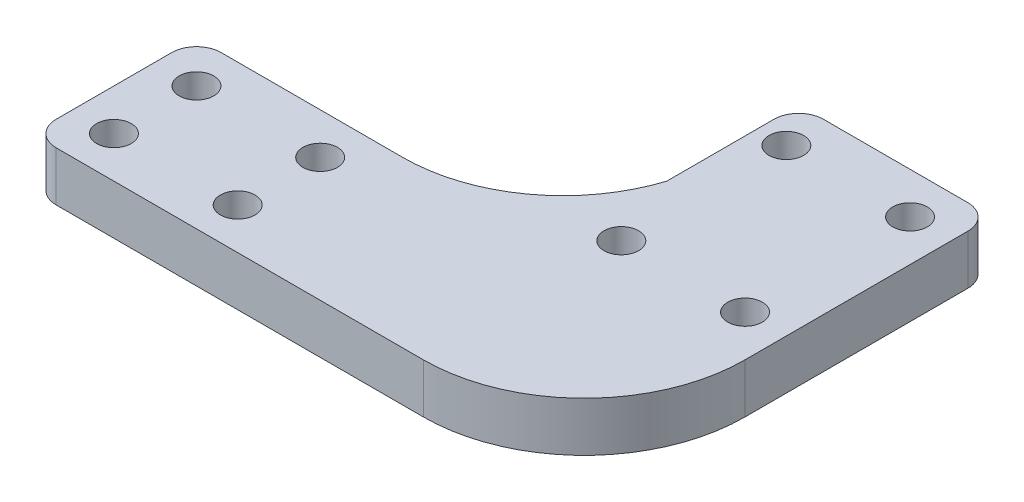
ISO-10303-21;
HEADER;
FILE_DESCRIPTION(('STEP AP214'),'2;1');
FILE_NAME('part.step','',(''),(''),'','','');
FILE_SCHEMA(('AUTOMOTIVE_DESIGN { 1 0 10303 214 1 1 1 1 }'));
ENDSEC;
DATA;
#1=APPLICATION_CONTEXT('core data for automotive mechanical design processes');
#2=APPLICATION_PROTOCOL_DEFINITION('international standard','automotive_design',2000,#1);
#3=PRODUCT_CONTEXT('',#1,'mechanical');
#4=PRODUCT('Part','Part','',(#3));
#5=PRODUCT_RELATED_PRODUCT_CATEGORY('part','',(#4));
#6=PRODUCT_DEFINITION_FORMATION('','',#4);
#7=PRODUCT_DEFINITION_CONTEXT('part definition',#1,'design');
#8=PRODUCT_DEFINITION('design','',#6,#7);
#9=PRODUCT_DEFINITION_SHAPE('','',#8);
#10=(LENGTH_UNIT() NAMED_UNIT(*) SI_UNIT(.MILLI.,.METRE.));
#11=(NAMED_UNIT(*) PLANE_ANGLE_UNIT() SI_UNIT($,.RADIAN.));
#12=(NAMED_UNIT(*) SI_UNIT($,.STERADIAN.) SOLID_ANGLE_UNIT());
#13=UNCERTAINTY_MEASURE_WITH_UNIT(LENGTH_MEASURE(1.E-05),#10,'distance_accuracy_value','');
#14=(GEOMETRIC_REPRESENTATION_CONTEXT(3) GLOBAL_UNCERTAINTY_ASSIGNED_CONTEXT((#13)) GLOBAL_UNIT_ASSIGNED_CONTEXT((#10,
#11,#12)) REPRESENTATION_CONTEXT('',''));
#15=CARTESIAN_POINT('',(0.,0.,0.));
#16=DIRECTION('',(0.,0.,1.));
#17=DIRECTION('',(1.,0.,0.));
#18=AXIS2_PLACEMENT_3D('',#15,#16,#17);
#19=CARTESIAN_POINT('',(-29.5,6.,-4.92592592592592));
#20=DIRECTION('',(0.,1.,0.));
#21=DIRECTION('',(0.,0.,1.));
#22=AXIS2_PLACEMENT_3D('',#19,#20,#21);
#23=PLANE('',#22);
#24=CARTESIAN_POINT('',(7.5,6.,-10.));
#25=DIRECTION('',(0.,1.,0.));
#26=DIRECTION('',(0.,0.,1.));
#27=AXIS2_PLACEMENT_3D('',#24,#25,#26);
#28=CIRCLE('',#27,2.1);
#29=CARTESIAN_POINT('',(7.5,6.,-7.9));
#30=VERTEX_POINT('',#29);
#31=EDGE_CURVE('E289',#30,#30,#28,.T.);
#32=ORIENTED_EDGE('',*,*,#31,.F.);
#33=EDGE_LOOP('',(#32));
#34=FACE_BOUND('',#33,.T.);
#35=CARTESIAN_POINT('',(-49.5,6.,29.5));
#36=DIRECTION('',(0.,1.,0.));
#37=DIRECTION('',(0.,0.,-1.));
#38=AXIS2_PLACEMENT_3D('',#35,#36,#37);
#39=CIRCLE('',#38,2.1);
#40=CARTESIAN_POINT('',(-49.5,6.,27.4));
#41=VERTEX_POINT('',#40);
#42=EDGE_CURVE('E277',#41,#41,#39,.T.);
#43=ORIENTED_EDGE('',*,*,#42,.F.);
#44=EDGE_LOOP('',(#43));
#45=FACE_BOUND('',#44,.T.);
#46=CARTESIAN_POINT('',(-34.5,6.,19.5));
#47=DIRECTION('',(0.,1.,0.));
#48=DIRECTION('',(0.,0.,-1.));
#49=AXIS2_PLACEMENT_3D('',#46,#47,#48);
#50=CIRCLE('',#49,2.1);
#51=CARTESIAN_POINT('',(-34.5,6.,17.4));
#52=VERTEX_POINT('',#51);
#53=EDGE_CURVE('E265',#52,#52,#50,.T.);
#54=ORIENTED_EDGE('',*,*,#53,.F.);
#55=EDGE_LOOP('',(#54));
#56=FACE_BOUND('',#55,.T.);
#57=CARTESIAN_POINT('',(-49.5,6.,19.5));
#58=DIRECTION('',(0.,1.,0.));
#59=DIRECTION('',(0.,0.,1.));
#60=AXIS2_PLACEMENT_3D('',#57,#58,#59);
#61=CIRCLE('',#60,2.1);
#62=CARTESIAN_POINT('',(-49.5,6.,21.6));
#63=VERTEX_POINT('',#62);
#64=EDGE_CURVE('E162',#63,#63,#61,.T.);
#65=ORIENTED_EDGE('',*,*,#64,.F.);
#66=EDGE_LOOP('',(#65));
#67=FACE_BOUND('',#66,.T.);
#68=DIRECTION('',(-1.,0.,0.));
#69=VECTOR('',#68,1.);
#70=CARTESIAN_POINT('',(-11.,6.,-15.));
#71=LINE('',#70,#69);
#72=CARTESIAN_POINT('',(9.5,6.,-15.));
#73=VERTEX_POINT('',#72);
#74=CARTESIAN_POINT('',(-8.,6.,-15.));
#75=VERTEX_POINT('',#74);
#76=EDGE_CURVE('E148',#73,#75,#71,.T.);
#77=ORIENTED_EDGE('',*,*,#76,.T.);
#78=CARTESIAN_POINT('',(-8.,6.,-12.));
#79=DIRECTION('',(0.,1.,0.));
#80=DIRECTION('',(0.,0.,1.));
#81=AXIS2_PLACEMENT_3D('',#78,#79,#80);
#82=CIRCLE('',#81,3.);
#83=CARTESIAN_POINT('',(-11.,6.,-12.));
#84=VERTEX_POINT('',#83);
#85=EDGE_CURVE('E204',#75,#84,#82,.T.);
#86=ORIENTED_EDGE('',*,*,#85,.T.);
#87=DIRECTION('',(0.,0.,1.));
#88=VECTOR('',#87,1.);
#89=CARTESIAN_POINT('',(-11.,6.,-15.));
#90=LINE('',#89,#88);
#91=CARTESIAN_POINT('',(-11.,6.,1.));
#92=VERTEX_POINT('',#91);
#93=EDGE_CURVE('E153',#84,#92,#90,.T.);
#94=ORIENTED_EDGE('',*,*,#93,.T.);
#95=CARTESIAN_POINT('',(-29.5,6.,-4.92592592592592));
#96=DIRECTION('',(0.,-1.,0.));
#97=DIRECTION('',(0.,0.,1.));
#98=AXIS2_PLACEMENT_3D('',#95,#96,#97);
#99=CIRCLE('',#98,19.4259259259259);
#100=CARTESIAN_POINT('',(-29.5,6.,14.5));
#101=VERTEX_POINT('',#100);
#102=EDGE_CURVE('E155',#92,#101,#99,.T.);
#103=ORIENTED_EDGE('',*,*,#102,.T.);
#104=DIRECTION('',(-1.,0.,0.));
#105=VECTOR('',#104,1.);
#106=CARTESIAN_POINT('',(-54.5,6.,14.5));
#107=LINE('',#106,#105);
#108=CARTESIAN_POINT('',(-51.5,6.,14.5));
#109=VERTEX_POINT('',#108);
#110=EDGE_CURVE('E177',#101,#109,#107,.T.);
#111=ORIENTED_EDGE('',*,*,#110,.T.);
#112=CARTESIAN_POINT('',(-51.5,6.,17.5));
#113=DIRECTION('',(0.,1.,0.));
#114=DIRECTION('',(0.,0.,1.));
#115=AXIS2_PLACEMENT_3D('',#112,#113,#114);
#116=CIRCLE('',#115,3.);
#117=CARTESIAN_POINT('',(-54.5,6.,17.5));
#118=VERTEX_POINT('',#117);
#119=EDGE_CURVE('E199',#109,#118,#116,.T.);
#120=ORIENTED_EDGE('',*,*,#119,.T.);
#121=DIRECTION('',(0.,0.,1.));
#122=VECTOR('',#121,1.);
#123=CARTESIAN_POINT('',(-54.5,6.,34.5));
#124=LINE('',#123,#122);
#125=CARTESIAN_POINT('',(-54.5,6.,31.5));
#126=VERTEX_POINT('',#125);
#127=EDGE_CURVE('E132',#118,#126,#124,.T.);
#128=ORIENTED_EDGE('',*,*,#127,.T.);
#129=CARTESIAN_POINT('',(-51.5,6.,31.5));
#130=DIRECTION('',(0.,1.,0.));
#131=DIRECTION('',(0.,0.,1.));
#132=AXIS2_PLACEMENT_3D('',#129,#130,#131);
#133=CIRCLE('',#132,3.);
#134=CARTESIAN_POINT('',(-51.5,6.,34.5));
#135=VERTEX_POINT('',#134);
#136=EDGE_CURVE('E57',#126,#135,#133,.T.);
#137=ORIENTED_EDGE('',*,*,#136,.T.);
#138=DIRECTION('',(1.,0.,0.));
#139=VECTOR('',#138,1.);
#140=CARTESIAN_POINT('',(-6.99999999999999,6.,34.5));
#141=LINE('',#140,#139);
#142=CARTESIAN_POINT('',(-6.99999999999999,6.,34.5));
#143=VERTEX_POINT('',#142);
#144=EDGE_CURVE('E122',#135,#143,#141,.T.);
#145=ORIENTED_EDGE('',*,*,#144,.T.);
#146=CARTESIAN_POINT('',(-6.99999999999999,6.,15.));
#147=DIRECTION('',(0.,1.,0.));
#148=DIRECTION('',(0.,0.,1.));
#149=AXIS2_PLACEMENT_3D('',#146,#147,#148);
#150=CIRCLE('',#149,19.5);
#151=CARTESIAN_POINT('',(12.5,6.,15.));
#152=VERTEX_POINT('',#151);
#153=EDGE_CURVE('E127',#143,#152,#150,.T.);
#154=ORIENTED_EDGE('',*,*,#153,.T.);
#155=DIRECTION('',(0.,0.,-1.));
#156=VECTOR('',#155,1.);
#157=CARTESIAN_POINT('',(12.5,6.,-15.));
#158=LINE('',#157,#156);
#159=CARTESIAN_POINT('',(12.5,6.,-12.));
#160=VERTEX_POINT('',#159);
#161=EDGE_CURVE('E146',#152,#160,#158,.T.);
#162=ORIENTED_EDGE('',*,*,#161,.T.);
#163=CARTESIAN_POINT('',(9.5,6.,-12.));
#164=DIRECTION('',(0.,1.,0.));
#165=DIRECTION('',(0.,0.,1.));
#166=AXIS2_PLACEMENT_3D('',#163,#164,#165);
#167=CIRCLE('',#166,3.);
#168=EDGE_CURVE('E202',#160,#73,#167,.T.);
#169=ORIENTED_EDGE('',*,*,#168,.T.);
#170=EDGE_LOOP('',(#77,#86,#94,#103,#111,#120,#128,#137,#145,#154,#162,#169));
#171=FACE_BOUND('',#170,.T.);
#172=CARTESIAN_POINT('',(-7.5,6.,10.));
#173=DIRECTION('',(0.,1.,0.));
#174=DIRECTION('',(0.,0.,1.));
#175=AXIS2_PLACEMENT_3D('',#172,#173,#174);
#176=CIRCLE('',#175,2.1);
#177=CARTESIAN_POINT('',(-7.5,6.,12.1));
#178=VERTEX_POINT('',#177);
#179=EDGE_CURVE('E259',#178,#178,#176,.T.);
#180=ORIENTED_EDGE('',*,*,#179,.F.);
#181=EDGE_LOOP('',(#180));
#182=FACE_BOUND('',#181,.T.);
#183=CARTESIAN_POINT('',(-34.5,6.,29.5));
#184=DIRECTION('',(0.,1.,0.));
#185=DIRECTION('',(0.,0.,1.));
#186=AXIS2_PLACEMENT_3D('',#183,#184,#185);
#187=CIRCLE('',#186,2.1);
#188=CARTESIAN_POINT('',(-34.5,6.,31.6));
#189=VERTEX_POINT('',#188);
#190=EDGE_CURVE('E271',#189,#189,#187,.T.);
#191=ORIENTED_EDGE('',*,*,#190,.F.);
#192=EDGE_LOOP('',(#191));
#193=FACE_BOUND('',#192,.T.);
#194=CARTESIAN_POINT('',(7.5,6.,10.));
#195=DIRECTION('',(0.,1.,0.));
#196=DIRECTION('',(0.,0.,-1.));
#197=AXIS2_PLACEMENT_3D('',#194,#195,#196);
#198=CIRCLE('',#197,2.1);
#199=CARTESIAN_POINT('',(7.5,6.,7.9));
#200=VERTEX_POINT('',#199);
#201=EDGE_CURVE('E283',#200,#200,#198,.T.);
#202=ORIENTED_EDGE('',*,*,#201,.F.);
#203=EDGE_LOOP('',(#202));
#204=FACE_BOUND('',#203,.T.);
#205=CARTESIAN_POINT('',(-7.5,6.,-10.));
#206=DIRECTION('',(0.,1.,0.));
#207=DIRECTION('',(0.,0.,-1.));
#208=AXIS2_PLACEMENT_3D('',#205,#206,#207);
#209=CIRCLE('',#208,2.1);
#210=CARTESIAN_POINT('',(-7.5,6.,-12.1));
#211=VERTEX_POINT('',#210);
#212=EDGE_CURVE('E295',#211,#211,#209,.T.);
#213=ORIENTED_EDGE('',*,*,#212,.F.);
#214=EDGE_LOOP('',(#213));
#215=FACE_BOUND('',#214,.T.);
#216=ADVANCED_FACE('F34',(#34,#45,#56,#67,#171,#182,#193,#204,#215),#23,.T.);
#217=CARTESIAN_POINT('',(-29.5,0.,-4.92592592592592));
#218=DIRECTION('',(0.,1.,0.));
#219=DIRECTION('',(0.,0.,1.));
#220=AXIS2_PLACEMENT_3D('',#217,#218,#219);
#221=PLANE('',#220);
#222=DIRECTION('',(0.,0.,1.));
#223=VECTOR('',#222,1.);
#224=CARTESIAN_POINT('',(-11.,0.,-15.));
#225=LINE('',#224,#223);
#226=CARTESIAN_POINT('',(-11.,0.,-12.));
#227=VERTEX_POINT('',#226);
#228=CARTESIAN_POINT('',(-11.,0.,1.));
#229=VERTEX_POINT('',#228);
#230=EDGE_CURVE('E173',#227,#229,#225,.T.);
#231=ORIENTED_EDGE('',*,*,#230,.F.);
#232=CARTESIAN_POINT('',(-8.,0.,-12.));
#233=DIRECTION('',(0.,1.,0.));
#234=DIRECTION('',(0.,0.,1.));
#235=AXIS2_PLACEMENT_3D('',#232,#233,#234);
#236=CIRCLE('',#235,3.);
#237=CARTESIAN_POINT('',(-8.,0.,-15.));
#238=VERTEX_POINT('',#237);
#239=EDGE_CURVE('E192',#227,#238,#236,.F.);
#240=ORIENTED_EDGE('',*,*,#239,.T.);
#241=DIRECTION('',(-1.,0.,0.));
#242=VECTOR('',#241,1.);
#243=CARTESIAN_POINT('',(-11.,0.,-15.));
#244=LINE('',#243,#242);
#245=CARTESIAN_POINT('',(9.5,0.,-15.));
#246=VERTEX_POINT('',#245);
#247=EDGE_CURVE('E170',#246,#238,#244,.T.);
#248=ORIENTED_EDGE('',*,*,#247,.F.);
#249=CARTESIAN_POINT('',(9.5,0.,-12.));
#250=DIRECTION('',(0.,1.,0.));
#251=DIRECTION('',(0.,0.,1.));
#252=AXIS2_PLACEMENT_3D('',#249,#250,#251);
#253=CIRCLE('',#252,3.);
#254=CARTESIAN_POINT('',(12.5,0.,-12.));
#255=VERTEX_POINT('',#254);
#256=EDGE_CURVE('E190',#246,#255,#253,.F.);
#257=ORIENTED_EDGE('',*,*,#256,.T.);
#258=DIRECTION('',(0.,0.,-1.));
#259=VECTOR('',#258,1.);
#260=CARTESIAN_POINT('',(12.5,0.,-15.));
#261=LINE('',#260,#259);
#262=CARTESIAN_POINT('',(12.5,0.,15.));
#263=VERTEX_POINT('',#262);
#264=EDGE_CURVE('E168',#263,#255,#261,.T.);
#265=ORIENTED_EDGE('',*,*,#264,.F.);
#266=CARTESIAN_POINT('',(-6.99999999999999,0.,15.));
#267=DIRECTION('',(0.,1.,0.));
#268=DIRECTION('',(0.,0.,1.));
#269=AXIS2_PLACEMENT_3D('',#266,#267,#268);
#270=CIRCLE('',#269,19.5);
#271=CARTESIAN_POINT('',(-6.99999999999999,0.,34.5));
#272=VERTEX_POINT('',#271);
#273=EDGE_CURVE('E166',#272,#263,#270,.T.);
#274=ORIENTED_EDGE('',*,*,#273,.F.);
#275=DIRECTION('',(1.,0.,0.));
#276=VECTOR('',#275,1.);
#277=CARTESIAN_POINT('',(-6.99999999999999,0.,34.5));
#278=LINE('',#277,#276);
#279=CARTESIAN_POINT('',(-51.5,0.,34.5));
#280=VERTEX_POINT('',#279);
#281=EDGE_CURVE('E138',#280,#272,#278,.T.);
#282=ORIENTED_EDGE('',*,*,#281,.F.);
#283=CARTESIAN_POINT('',(-51.5,0.,31.5));
#284=DIRECTION('',(0.,1.,0.));
#285=DIRECTION('',(0.,0.,1.));
#286=AXIS2_PLACEMENT_3D('',#283,#284,#285);
#287=CIRCLE('',#286,3.);
#288=CARTESIAN_POINT('',(-54.5,0.,31.5));
#289=VERTEX_POINT('',#288);
#290=EDGE_CURVE('E188',#280,#289,#287,.F.);
#291=ORIENTED_EDGE('',*,*,#290,.T.);
#292=DIRECTION('',(0.,0.,1.));
#293=VECTOR('',#292,1.);
#294=CARTESIAN_POINT('',(-54.5,0.,34.5));
#295=LINE('',#294,#293);
#296=CARTESIAN_POINT('',(-54.5,0.,17.5));
#297=VERTEX_POINT('',#296);
#298=EDGE_CURVE('E161',#297,#289,#295,.T.);
#299=ORIENTED_EDGE('',*,*,#298,.F.);
#300=CARTESIAN_POINT('',(-51.5,0.,17.5));
#301=DIRECTION('',(0.,1.,0.));
#302=DIRECTION('',(0.,0.,1.));
#303=AXIS2_PLACEMENT_3D('',#300,#301,#302);
#304=CIRCLE('',#303,3.);
#305=CARTESIAN_POINT('',(-51.5,0.,14.5));
#306=VERTEX_POINT('',#305);
#307=EDGE_CURVE('E186',#297,#306,#304,.F.);
#308=ORIENTED_EDGE('',*,*,#307,.T.);
#309=DIRECTION('',(-1.,0.,0.));
#310=VECTOR('',#309,1.);
#311=CARTESIAN_POINT('',(-54.5,0.,14.5));
#312=LINE('',#311,#310);
#313=CARTESIAN_POINT('',(-29.5,0.,14.5));
#314=VERTEX_POINT('',#313);
#315=EDGE_CURVE('E158',#314,#306,#312,.T.);
#316=ORIENTED_EDGE('',*,*,#315,.F.);
#317=CARTESIAN_POINT('',(-29.5,0.,-4.92592592592592));
#318=DIRECTION('',(0.,-1.,0.));
#319=DIRECTION('',(0.,0.,1.));
#320=AXIS2_PLACEMENT_3D('',#317,#318,#319);
#321=CIRCLE('',#320,19.4259259259259);
#322=EDGE_CURVE('E175',#229,#314,#321,.T.);
#323=ORIENTED_EDGE('',*,*,#322,.F.);
#324=EDGE_LOOP('',(#231,#240,#248,#257,#265,#274,#282,#291,#299,#308,#316,#323));
#325=FACE_BOUND('',#324,.T.);
#326=CARTESIAN_POINT('',(-49.5,0.,19.5));
#327=DIRECTION('',(0.,1.,0.));
#328=DIRECTION('',(0.,0.,1.));
#329=AXIS2_PLACEMENT_3D('',#326,#327,#328);
#330=CIRCLE('',#329,2.1);
#331=CARTESIAN_POINT('',(-49.5,0.,21.6));
#332=VERTEX_POINT('',#331);
#333=EDGE_CURVE('E256',#332,#332,#330,.T.);
#334=ORIENTED_EDGE('',*,*,#333,.T.);
#335=EDGE_LOOP('',(#334));
#336=FACE_BOUND('',#335,.T.);
#337=CARTESIAN_POINT('',(-7.5,0.,10.));
#338=DIRECTION('',(0.,1.,0.));
#339=DIRECTION('',(0.,0.,1.));
#340=AXIS2_PLACEMENT_3D('',#337,#338,#339);
#341=CIRCLE('',#340,2.1);
#342=CARTESIAN_POINT('',(-7.5,0.,12.1));
#343=VERTEX_POINT('',#342);
#344=EDGE_CURVE('E262',#343,#343,#341,.T.);
#345=ORIENTED_EDGE('',*,*,#344,.T.);
#346=EDGE_LOOP('',(#345));
#347=FACE_BOUND('',#346,.T.);
#348=CARTESIAN_POINT('',(-34.5,0.,19.5));
#349=DIRECTION('',(0.,1.,0.));
#350=DIRECTION('',(0.,0.,-1.));
#351=AXIS2_PLACEMENT_3D('',#348,#349,#350);
#352=CIRCLE('',#351,2.1);
#353=CARTESIAN_POINT('',(-34.5,0.,17.4));
#354=VERTEX_POINT('',#353);
#355=EDGE_CURVE('E268',#354,#354,#352,.T.);
#356=ORIENTED_EDGE('',*,*,#355,.T.);
#357=EDGE_LOOP('',(#356));
#358=FACE_BOUND('',#357,.T.);
#359=CARTESIAN_POINT('',(-34.5,0.,29.5));
#360=DIRECTION('',(0.,1.,0.));
#361=DIRECTION('',(0.,0.,1.));
#362=AXIS2_PLACEMENT_3D('',#359,#360,#361);
#363=CIRCLE('',#362,2.1);
#364=CARTESIAN_POINT('',(-34.5,0.,31.6));
#365=VERTEX_POINT('',#364);
#366=EDGE_CURVE('E274',#365,#365,#363,.T.);
#367=ORIENTED_EDGE('',*,*,#366,.T.);
#368=EDGE_LOOP('',(#367));
#369=FACE_BOUND('',#368,.T.);
#370=CARTESIAN_POINT('',(-49.5,0.,29.5));
#371=DIRECTION('',(0.,1.,0.));
#372=DIRECTION('',(0.,0.,-1.));
#373=AXIS2_PLACEMENT_3D('',#370,#371,#372);
#374=CIRCLE('',#373,2.1);
#375=CARTESIAN_POINT('',(-49.5,0.,27.4));
#376=VERTEX_POINT('',#375);
#377=EDGE_CURVE('E280',#376,#376,#374,.T.);
#378=ORIENTED_EDGE('',*,*,#377,.T.);
#379=EDGE_LOOP('',(#378));
#380=FACE_BOUND('',#379,.T.);
#381=CARTESIAN_POINT('',(7.5,0.,10.));
#382=DIRECTION('',(0.,1.,0.));
#383=DIRECTION('',(0.,0.,-1.));
#384=AXIS2_PLACEMENT_3D('',#381,#382,#383);
#385=CIRCLE('',#384,2.1);
#386=CARTESIAN_POINT('',(7.5,0.,7.9));
#387=VERTEX_POINT('',#386);
#388=EDGE_CURVE('E286',#387,#387,#385,.T.);
#389=ORIENTED_EDGE('',*,*,#388,.T.);
#390=EDGE_LOOP('',(#389));
#391=FACE_BOUND('',#390,.T.);
#392=CARTESIAN_POINT('',(7.5,0.,-10.));
#393=DIRECTION('',(0.,1.,0.));
#394=DIRECTION('',(0.,0.,1.));
#395=AXIS2_PLACEMENT_3D('',#392,#393,#394);
#396=CIRCLE('',#395,2.1);
#397=CARTESIAN_POINT('',(7.5,0.,-7.9));
#398=VERTEX_POINT('',#397);
#399=EDGE_CURVE('E292',#398,#398,#396,.T.);
#400=ORIENTED_EDGE('',*,*,#399,.T.);
#401=EDGE_LOOP('',(#400));
#402=FACE_BOUND('',#401,.T.);
#403=CARTESIAN_POINT('',(-7.5,0.,-10.));
#404=DIRECTION('',(0.,1.,0.));
#405=DIRECTION('',(0.,0.,-1.));
#406=AXIS2_PLACEMENT_3D('',#403,#404,#405);
#407=CIRCLE('',#406,2.1);
#408=CARTESIAN_POINT('',(-7.5,0.,-12.1));
#409=VERTEX_POINT('',#408);
#410=EDGE_CURVE('E298',#409,#409,#407,.T.);
#411=ORIENTED_EDGE('',*,*,#410,.T.);
#412=EDGE_LOOP('',(#411));
#413=FACE_BOUND('',#412,.T.);
#414=ADVANCED_FACE('F223',(#325,#336,#347,#358,#369,#380,#391,#402,#413),#221,.F.);
#415=CARTESIAN_POINT('',(-54.5,6.,14.5));
#416=DIRECTION('',(0.,0.,1.));
#417=DIRECTION('',(1.,0.,0.));
#418=AXIS2_PLACEMENT_3D('',#415,#416,#417);
#419=PLANE('',#418);
#420=ORIENTED_EDGE('',*,*,#315,.T.);
#421=DIRECTION('',(0.,-1.,0.));
#422=VECTOR('',#421,1.);
#423=CARTESIAN_POINT('',(-51.5,6.,14.5));
#424=LINE('',#423,#422);
#425=EDGE_CURVE('E11',#306,#109,#424,.F.);
#426=ORIENTED_EDGE('',*,*,#425,.T.);
#427=ORIENTED_EDGE('',*,*,#110,.F.);
#428=DIRECTION('',(0.,-1.,0.));
#429=VECTOR('',#428,1.);
#430=CARTESIAN_POINT('',(-29.5,6.,14.5));
#431=LINE('',#430,#429);
#432=EDGE_CURVE('E157',#101,#314,#431,.T.);
#433=ORIENTED_EDGE('',*,*,#432,.T.);
#434=EDGE_LOOP('',(#420,#426,#427,#433));
#435=FACE_BOUND('',#434,.T.);
#436=ADVANCED_FACE('F252',(#435),#419,.F.);
#437=CARTESIAN_POINT('',(-54.5,6.,34.5));
#438=DIRECTION('',(1.,0.,0.));
#439=DIRECTION('',(0.,0.,-1.));
#440=AXIS2_PLACEMENT_3D('',#437,#438,#439);
#441=PLANE('',#440);
#442=ORIENTED_EDGE('',*,*,#298,.T.);
#443=DIRECTION('',(0.,-1.,0.));
#444=VECTOR('',#443,1.);
#445=CARTESIAN_POINT('',(-54.5,6.,31.5));
#446=LINE('',#445,#444);
#447=EDGE_CURVE('E42',#289,#126,#446,.F.);
#448=ORIENTED_EDGE('',*,*,#447,.T.);
#449=ORIENTED_EDGE('',*,*,#127,.F.);
#450=DIRECTION('',(0.,-1.,0.));
#451=VECTOR('',#450,1.);
#452=CARTESIAN_POINT('',(-54.5,6.,17.5));
#453=LINE('',#452,#451);
#454=EDGE_CURVE('E209',#118,#297,#453,.T.);
#455=ORIENTED_EDGE('',*,*,#454,.T.);
#456=EDGE_LOOP('',(#442,#448,#449,#455));
#457=FACE_BOUND('',#456,.T.);
#458=ADVANCED_FACE('F214',(#457),#441,.F.);
#459=CARTESIAN_POINT('',(-6.99999999999999,6.,34.5));
#460=DIRECTION('',(0.,0.,-1.));
#461=DIRECTION('',(-1.,0.,0.));
#462=AXIS2_PLACEMENT_3D('',#459,#460,#461);
#463=PLANE('',#462);
#464=ORIENTED_EDGE('',*,*,#144,.F.);
#465=DIRECTION('',(0.,-1.,0.));
#466=VECTOR('',#465,1.);
#467=CARTESIAN_POINT('',(-51.5,6.,34.5));
#468=LINE('',#467,#466);
#469=EDGE_CURVE('E207',#135,#280,#468,.T.);
#470=ORIENTED_EDGE('',*,*,#469,.T.);
#471=ORIENTED_EDGE('',*,*,#281,.T.);
#472=DIRECTION('',(0.,-1.,0.));
#473=VECTOR('',#472,1.);
#474=CARTESIAN_POINT('',(-6.99999999999999,6.,34.5));
#475=LINE('',#474,#473);
#476=EDGE_CURVE('E135',#143,#272,#475,.T.);
#477=ORIENTED_EDGE('',*,*,#476,.F.);
#478=EDGE_LOOP('',(#464,#470,#471,#477));
#479=FACE_BOUND('',#478,.T.);
#480=ADVANCED_FACE('F136',(#479),#463,.F.);
#481=CARTESIAN_POINT('',(-6.99999999999999,6.,15.));
#482=DIRECTION('',(0.,-1.,0.));
#483=DIRECTION('',(0.,0.,-1.));
#484=AXIS2_PLACEMENT_3D('',#481,#482,#483);
#485=CYLINDRICAL_SURFACE('',#484,19.5);
#486=ORIENTED_EDGE('',*,*,#273,.T.);
#487=DIRECTION('',(0.,-1.,0.));
#488=VECTOR('',#487,1.);
#489=CARTESIAN_POINT('',(12.5,6.,15.));
#490=LINE('',#489,#488);
#491=EDGE_CURVE('E142',#152,#263,#490,.T.);
#492=ORIENTED_EDGE('',*,*,#491,.F.);
#493=ORIENTED_EDGE('',*,*,#153,.F.);
#494=ORIENTED_EDGE('',*,*,#476,.T.);
#495=EDGE_LOOP('',(#486,#492,#493,#494));
#496=FACE_BOUND('',#495,.T.);
#497=ADVANCED_FACE('F144',(#496),#485,.T.);
#498=CARTESIAN_POINT('',(12.5,6.,-15.));
#499=DIRECTION('',(-1.,0.,0.));
#500=DIRECTION('',(0.,0.,1.));
#501=AXIS2_PLACEMENT_3D('',#498,#499,#500);
#502=PLANE('',#501);
#503=ORIENTED_EDGE('',*,*,#264,.T.);
#504=DIRECTION('',(0.,-1.,0.));
#505=VECTOR('',#504,1.);
#506=CARTESIAN_POINT('',(12.5,6.,-12.));
#507=LINE('',#506,#505);
#508=EDGE_CURVE('E49',#255,#160,#507,.F.);
#509=ORIENTED_EDGE('',*,*,#508,.T.);
#510=ORIENTED_EDGE('',*,*,#161,.F.);
#511=ORIENTED_EDGE('',*,*,#491,.T.);
#512=EDGE_LOOP('',(#503,#509,#510,#511));
#513=FACE_BOUND('',#512,.T.);
#514=ADVANCED_FACE('F226',(#513),#502,.F.);
#515=CARTESIAN_POINT('',(-11.,6.,-15.));
#516=DIRECTION('',(0.,0.,1.));
#517=DIRECTION('',(1.,0.,0.));
#518=AXIS2_PLACEMENT_3D('',#515,#516,#517);
#519=PLANE('',#518);
#520=ORIENTED_EDGE('',*,*,#247,.T.);
#521=DIRECTION('',(0.,-1.,0.));
#522=VECTOR('',#521,1.);
#523=CARTESIAN_POINT('',(-8.,6.,-15.));
#524=LINE('',#523,#522);
#525=EDGE_CURVE('E197',#238,#75,#524,.F.);
#526=ORIENTED_EDGE('',*,*,#525,.T.);
#527=ORIENTED_EDGE('',*,*,#76,.F.);
#528=DIRECTION('',(0.,-1.,0.));
#529=VECTOR('',#528,1.);
#530=CARTESIAN_POINT('',(9.5,6.,-15.));
#531=LINE('',#530,#529);
#532=EDGE_CURVE('E194',#73,#246,#531,.T.);
#533=ORIENTED_EDGE('',*,*,#532,.T.);
#534=EDGE_LOOP('',(#520,#526,#527,#533));
#535=FACE_BOUND('',#534,.T.);
#536=ADVANCED_FACE('F234',(#535),#519,.F.);
#537=CARTESIAN_POINT('',(-11.,6.,-15.));
#538=DIRECTION('',(1.,0.,0.));
#539=DIRECTION('',(0.,0.,-1.));
#540=AXIS2_PLACEMENT_3D('',#537,#538,#539);
#541=PLANE('',#540);
#542=ORIENTED_EDGE('',*,*,#93,.F.);
#543=DIRECTION('',(0.,-1.,0.));
#544=VECTOR('',#543,1.);
#545=CARTESIAN_POINT('',(-11.,6.,-12.));
#546=LINE('',#545,#544);
#547=EDGE_CURVE('E141',#84,#227,#546,.T.);
#548=ORIENTED_EDGE('',*,*,#547,.T.);
#549=ORIENTED_EDGE('',*,*,#230,.T.);
#550=DIRECTION('',(0.,-1.,0.));
#551=VECTOR('',#550,1.);
#552=CARTESIAN_POINT('',(-11.,6.,1.));
#553=LINE('',#552,#551);
#554=EDGE_CURVE('E180',#92,#229,#553,.T.);
#555=ORIENTED_EDGE('',*,*,#554,.F.);
#556=EDGE_LOOP('',(#542,#548,#549,#555));
#557=FACE_BOUND('',#556,.T.);
#558=ADVANCED_FACE('F243',(#557),#541,.F.);
#559=CARTESIAN_POINT('',(-29.5,6.,-4.92592592592592));
#560=DIRECTION('',(0.,-1.,0.));
#561=DIRECTION('',(0.,0.,-1.));
#562=AXIS2_PLACEMENT_3D('',#559,#560,#561);
#563=CYLINDRICAL_SURFACE('',#562,19.4259259259259);
#564=ORIENTED_EDGE('',*,*,#322,.T.);
#565=ORIENTED_EDGE('',*,*,#432,.F.);
#566=ORIENTED_EDGE('',*,*,#102,.F.);
#567=ORIENTED_EDGE('',*,*,#554,.T.);
#568=EDGE_LOOP('',(#564,#565,#566,#567));
#569=FACE_BOUND('',#568,.T.);
#570=ADVANCED_FACE('F249',(#569),#563,.F.);
#571=CARTESIAN_POINT('',(-49.5,6.,19.5));
#572=DIRECTION('',(0.,-1.,0.));
#573=DIRECTION('',(0.,0.,-1.));
#574=AXIS2_PLACEMENT_3D('',#571,#572,#573);
#575=CYLINDRICAL_SURFACE('',#574,2.1);
#576=ORIENTED_EDGE('',*,*,#64,.T.);
#577=EDGE_LOOP('',(#576));
#578=FACE_BOUND('',#577,.T.);
#579=ORIENTED_EDGE('',*,*,#333,.F.);
#580=EDGE_LOOP('',(#579));
#581=FACE_BOUND('',#580,.T.);
#582=ADVANCED_FACE('F317',(#578,#581),#575,.F.);
#583=CARTESIAN_POINT('',(-7.5,6.,10.));
#584=DIRECTION('',(0.,-1.,0.));
#585=DIRECTION('',(0.,0.,-1.));
#586=AXIS2_PLACEMENT_3D('',#583,#584,#585);
#587=CYLINDRICAL_SURFACE('',#586,2.1);
#588=ORIENTED_EDGE('',*,*,#179,.T.);
#589=EDGE_LOOP('',(#588));
#590=FACE_BOUND('',#589,.T.);
#591=ORIENTED_EDGE('',*,*,#344,.F.);
#592=EDGE_LOOP('',(#591));
#593=FACE_BOUND('',#592,.T.);
#594=ADVANCED_FACE('F468',(#590,#593),#587,.F.);
#595=CARTESIAN_POINT('',(-34.5,6.,19.5));
#596=DIRECTION('',(0.,-1.,0.));
#597=DIRECTION('',(0.,0.,-1.));
#598=AXIS2_PLACEMENT_3D('',#595,#596,#597);
#599=CYLINDRICAL_SURFACE('',#598,2.1);
#600=ORIENTED_EDGE('',*,*,#53,.T.);
#601=EDGE_LOOP('',(#600));
#602=FACE_BOUND('',#601,.T.);
#603=ORIENTED_EDGE('',*,*,#355,.F.);
#604=EDGE_LOOP('',(#603));
#605=FACE_BOUND('',#604,.T.);
#606=ADVANCED_FACE('F458',(#602,#605),#599,.F.);
#607=CARTESIAN_POINT('',(-34.5,6.,29.5));
#608=DIRECTION('',(0.,-1.,0.));
#609=DIRECTION('',(0.,0.,-1.));
#610=AXIS2_PLACEMENT_3D('',#607,#608,#609);
#611=CYLINDRICAL_SURFACE('',#610,2.1);
#612=ORIENTED_EDGE('',*,*,#190,.T.);
#613=EDGE_LOOP('',(#612));
#614=FACE_BOUND('',#613,.T.);
#615=ORIENTED_EDGE('',*,*,#366,.F.);
#616=EDGE_LOOP('',(#615));
#617=FACE_BOUND('',#616,.T.);
#618=ADVANCED_FACE('F448',(#614,#617),#611,.F.);
#619=CARTESIAN_POINT('',(-49.5,6.,29.5));
#620=DIRECTION('',(0.,-1.,0.));
#621=DIRECTION('',(0.,0.,-1.));
#622=AXIS2_PLACEMENT_3D('',#619,#620,#621);
#623=CYLINDRICAL_SURFACE('',#622,2.1);
#624=ORIENTED_EDGE('',*,*,#42,.T.);
#625=EDGE_LOOP('',(#624));
#626=FACE_BOUND('',#625,.T.);
#627=ORIENTED_EDGE('',*,*,#377,.F.);
#628=EDGE_LOOP('',(#627));
#629=FACE_BOUND('',#628,.T.);
#630=ADVANCED_FACE('F438',(#626,#629),#623,.F.);
#631=CARTESIAN_POINT('',(7.5,6.,10.));
#632=DIRECTION('',(0.,-1.,0.));
#633=DIRECTION('',(0.,0.,-1.));
#634=AXIS2_PLACEMENT_3D('',#631,#632,#633);
#635=CYLINDRICAL_SURFACE('',#634,2.1);
#636=ORIENTED_EDGE('',*,*,#201,.T.);
#637=EDGE_LOOP('',(#636));
#638=FACE_BOUND('',#637,.T.);
#639=ORIENTED_EDGE('',*,*,#388,.F.);
#640=EDGE_LOOP('',(#639));
#641=FACE_BOUND('',#640,.T.);
#642=ADVANCED_FACE('F428',(#638,#641),#635,.F.);
#643=CARTESIAN_POINT('',(7.5,6.,-10.));
#644=DIRECTION('',(0.,-1.,0.));
#645=DIRECTION('',(0.,0.,-1.));
#646=AXIS2_PLACEMENT_3D('',#643,#644,#645);
#647=CYLINDRICAL_SURFACE('',#646,2.1);
#648=ORIENTED_EDGE('',*,*,#31,.T.);
#649=EDGE_LOOP('',(#648));
#650=FACE_BOUND('',#649,.T.);
#651=ORIENTED_EDGE('',*,*,#399,.F.);
#652=EDGE_LOOP('',(#651));
#653=FACE_BOUND('',#652,.T.);
#654=ADVANCED_FACE('F419',(#650,#653),#647,.F.);
#655=CARTESIAN_POINT('',(-7.5,6.,-10.));
#656=DIRECTION('',(0.,-1.,0.));
#657=DIRECTION('',(0.,0.,-1.));
#658=AXIS2_PLACEMENT_3D('',#655,#656,#657);
#659=CYLINDRICAL_SURFACE('',#658,2.1);
#660=ORIENTED_EDGE('',*,*,#212,.T.);
#661=EDGE_LOOP('',(#660));
#662=FACE_BOUND('',#661,.T.);
#663=ORIENTED_EDGE('',*,*,#410,.F.);
#664=EDGE_LOOP('',(#663));
#665=FACE_BOUND('',#664,.T.);
#666=ADVANCED_FACE('F304',(#662,#665),#659,.F.);
#667=CARTESIAN_POINT('',(-8.,6.,-12.));
#668=DIRECTION('',(0.,-1.,0.));
#669=DIRECTION('',(0.,0.,-1.));
#670=AXIS2_PLACEMENT_3D('',#667,#668,#669);
#671=CYLINDRICAL_SURFACE('',#670,3.);
#672=ORIENTED_EDGE('',*,*,#85,.F.);
#673=ORIENTED_EDGE('',*,*,#525,.F.);
#674=ORIENTED_EDGE('',*,*,#239,.F.);
#675=ORIENTED_EDGE('',*,*,#547,.F.);
#676=EDGE_LOOP('',(#672,#673,#674,#675));
#677=FACE_BOUND('',#676,.T.);
#678=ADVANCED_FACE('F240',(#677),#671,.T.);
#679=CARTESIAN_POINT('',(9.5,6.,-12.));
#680=DIRECTION('',(0.,-1.,0.));
#681=DIRECTION('',(0.,0.,-1.));
#682=AXIS2_PLACEMENT_3D('',#679,#680,#681);
#683=CYLINDRICAL_SURFACE('',#682,3.);
#684=ORIENTED_EDGE('',*,*,#168,.F.);
#685=ORIENTED_EDGE('',*,*,#508,.F.);
#686=ORIENTED_EDGE('',*,*,#256,.F.);
#687=ORIENTED_EDGE('',*,*,#532,.F.);
#688=EDGE_LOOP('',(#684,#685,#686,#687));
#689=FACE_BOUND('',#688,.T.);
#690=ADVANCED_FACE('F231',(#689),#683,.T.);
#691=CARTESIAN_POINT('',(-51.5,6.,31.5));
#692=DIRECTION('',(0.,-1.,0.));
#693=DIRECTION('',(0.,0.,-1.));
#694=AXIS2_PLACEMENT_3D('',#691,#692,#693);
#695=CYLINDRICAL_SURFACE('',#694,3.);
#696=ORIENTED_EDGE('',*,*,#136,.F.);
#697=ORIENTED_EDGE('',*,*,#447,.F.);
#698=ORIENTED_EDGE('',*,*,#290,.F.);
#699=ORIENTED_EDGE('',*,*,#469,.F.);
#700=EDGE_LOOP('',(#696,#697,#698,#699));
#701=FACE_BOUND('',#700,.T.);
#702=ADVANCED_FACE('F220',(#701),#695,.T.);
#703=CARTESIAN_POINT('',(-51.5,6.,17.5));
#704=DIRECTION('',(0.,-1.,0.));
#705=DIRECTION('',(0.,0.,-1.));
#706=AXIS2_PLACEMENT_3D('',#703,#704,#705);
#707=CYLINDRICAL_SURFACE('',#706,3.);
#708=ORIENTED_EDGE('',*,*,#119,.F.);
#709=ORIENTED_EDGE('',*,*,#425,.F.);
#710=ORIENTED_EDGE('',*,*,#307,.F.);
#711=ORIENTED_EDGE('',*,*,#454,.F.);
#712=EDGE_LOOP('',(#708,#709,#710,#711));
#713=FACE_BOUND('',#712,.T.);
#714=ADVANCED_FACE('F36',(#713),#707,.T.);
#715=CLOSED_SHELL('',(#216,#414,#436,#458,#480,#497,#514,#536,#558,#570,#582,#594,#606,#618,
#630,#642,#654,#666,#678,#690,#702,#714));
#716=MANIFOLD_SOLID_BREP('B2',#715);
#717=ADVANCED_BREP_SHAPE_REPRESENTATION('',(#18,#716),#14);
#718=SHAPE_DEFINITION_REPRESENTATION(#9,#717);
ENDSEC;
END-ISO-10303-21;
